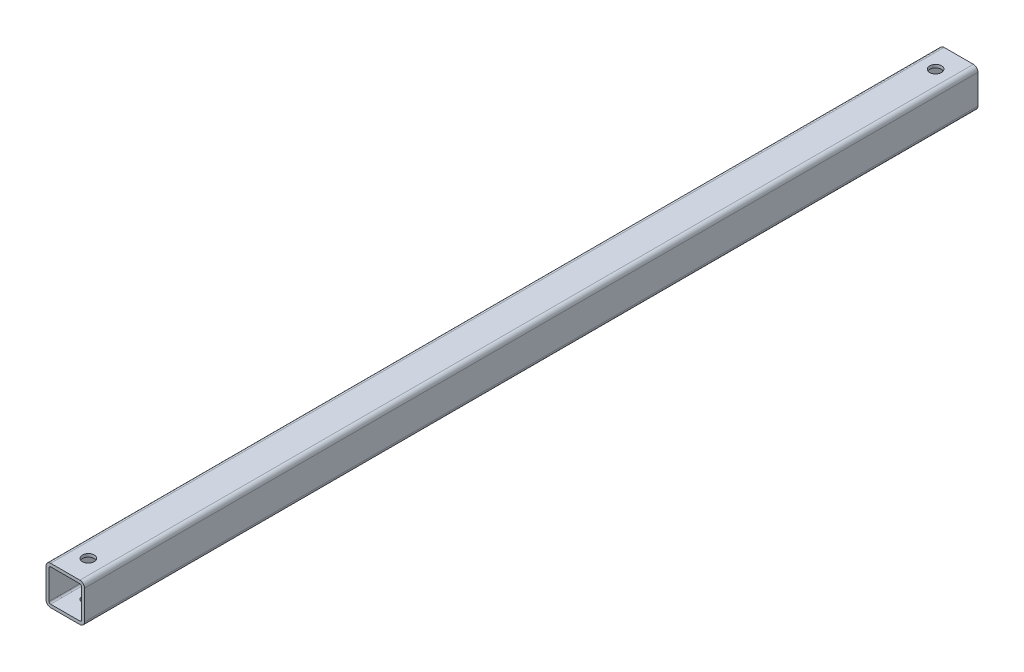
ISO-10303-21;
HEADER;
FILE_DESCRIPTION(('STEP AP214'),'2;1');
FILE_NAME('part.step','',(''),(''),'','','');
FILE_SCHEMA(('AUTOMOTIVE_DESIGN { 1 0 10303 214 1 1 1 1 }'));
ENDSEC;
DATA;
#1=APPLICATION_CONTEXT('core data for automotive mechanical design processes');
#2=APPLICATION_PROTOCOL_DEFINITION('international standard','automotive_design',2000,#1);
#3=PRODUCT_CONTEXT('',#1,'mechanical');
#4=PRODUCT('Part','Part','',(#3));
#5=PRODUCT_RELATED_PRODUCT_CATEGORY('part','',(#4));
#6=PRODUCT_DEFINITION_FORMATION('','',#4);
#7=PRODUCT_DEFINITION_CONTEXT('part definition',#1,'design');
#8=PRODUCT_DEFINITION('design','',#6,#7);
#9=PRODUCT_DEFINITION_SHAPE('','',#8);
#10=(LENGTH_UNIT() NAMED_UNIT(*) SI_UNIT(.MILLI.,.METRE.));
#11=(NAMED_UNIT(*) PLANE_ANGLE_UNIT() SI_UNIT($,.RADIAN.));
#12=(NAMED_UNIT(*) SI_UNIT($,.STERADIAN.) SOLID_ANGLE_UNIT());
#13=UNCERTAINTY_MEASURE_WITH_UNIT(LENGTH_MEASURE(1.E-05),#10,'distance_accuracy_value','');
#14=(GEOMETRIC_REPRESENTATION_CONTEXT(3) GLOBAL_UNCERTAINTY_ASSIGNED_CONTEXT((#13)) GLOBAL_UNIT_ASSIGNED_CONTEXT((#10,
#11,#12)) REPRESENTATION_CONTEXT('',''));
#15=CARTESIAN_POINT('',(0.,0.,0.));
#16=DIRECTION('',(0.,0.,1.));
#17=DIRECTION('',(1.,0.,0.));
#18=AXIS2_PLACEMENT_3D('',#15,#16,#17);
#19=CARTESIAN_POINT('',(7.67386154620908E-12,1.48148160405981E-11,580.000000000016));
#20=DIRECTION('',(0.,0.,1.));
#21=DIRECTION('',(1.,0.,0.));
#22=AXIS2_PLACEMENT_3D('',#19,#20,#21);
#23=PLANE('',#22);
#24=DIRECTION('',(0.,1.,0.));
#25=VECTOR('',#24,1.);
#26=CARTESIAN_POINT('',(-12.4999999999923,-4.7499999999852,580.000000000016));
#27=LINE('',#26,#25);
#28=CARTESIAN_POINT('',(-12.4999999999923,-9.49999999998518,580.000000000016));
#29=VERTEX_POINT('',#28);
#30=CARTESIAN_POINT('',(-12.4999999999923,9.50000000001481,580.000000000016));
#31=VERTEX_POINT('',#30);
#32=EDGE_CURVE('E193',#29,#31,#27,.T.);
#33=ORIENTED_EDGE('',*,*,#32,.F.);
#34=CARTESIAN_POINT('',(-9.49999999999235,-9.49999999998518,580.000000000016));
#35=DIRECTION('',(0.,0.,-1.));
#36=DIRECTION('',(1.,0.,0.));
#37=AXIS2_PLACEMENT_3D('',#34,#35,#36);
#38=CIRCLE('',#37,3.);
#39=CARTESIAN_POINT('',(-9.49999999999235,-12.4999999999852,580.000000000016));
#40=VERTEX_POINT('',#39);
#41=EDGE_CURVE('E253',#40,#29,#38,.T.);
#42=ORIENTED_EDGE('',*,*,#41,.F.);
#43=DIRECTION('',(-1.,0.,0.));
#44=VECTOR('',#43,1.);
#45=CARTESIAN_POINT('',(4.75000000000776,-12.4999999999852,580.000000000016));
#46=LINE('',#45,#44);
#47=CARTESIAN_POINT('',(9.5000000000077,-12.4999999999852,580.000000000017));
#48=VERTEX_POINT('',#47);
#49=EDGE_CURVE('E238',#48,#40,#46,.T.);
#50=ORIENTED_EDGE('',*,*,#49,.F.);
#51=CARTESIAN_POINT('',(9.5000000000077,-9.49999999998518,580.000000000016));
#52=DIRECTION('',(0.,0.,-1.));
#53=DIRECTION('',(0.,1.,0.));
#54=AXIS2_PLACEMENT_3D('',#51,#52,#53);
#55=CIRCLE('',#54,3.);
#56=CARTESIAN_POINT('',(12.5000000000077,-9.49999999998518,580.000000000016));
#57=VERTEX_POINT('',#56);
#58=EDGE_CURVE('E332',#57,#48,#55,.T.);
#59=ORIENTED_EDGE('',*,*,#58,.F.);
#60=DIRECTION('',(0.,-1.,0.));
#61=VECTOR('',#60,1.);
#62=CARTESIAN_POINT('',(12.5000000000077,4.75000000001483,580.000000000017));
#63=LINE('',#62,#61);
#64=CARTESIAN_POINT('',(12.5000000000077,9.50000000001481,580.000000000016));
#65=VERTEX_POINT('',#64);
#66=EDGE_CURVE('E309',#65,#57,#63,.T.);
#67=ORIENTED_EDGE('',*,*,#66,.F.);
#68=CARTESIAN_POINT('',(9.5000000000077,9.50000000001481,580.000000000016));
#69=DIRECTION('',(0.,0.,-1.));
#70=DIRECTION('',(-1.,0.,0.));
#71=AXIS2_PLACEMENT_3D('',#68,#69,#70);
#72=CIRCLE('',#71,3.);
#73=CARTESIAN_POINT('',(9.5000000000077,12.5000000000148,580.000000000017));
#74=VERTEX_POINT('',#73);
#75=EDGE_CURVE('E27',#74,#65,#72,.T.);
#76=ORIENTED_EDGE('',*,*,#75,.F.);
#77=DIRECTION('',(1.,0.,0.));
#78=VECTOR('',#77,1.);
#79=CARTESIAN_POINT('',(-4.74999999999227,12.5000000000148,580.000000000017));
#80=LINE('',#79,#78);
#81=CARTESIAN_POINT('',(-9.49999999999235,12.5000000000148,580.000000000016));
#82=VERTEX_POINT('',#81);
#83=EDGE_CURVE('E259',#82,#74,#80,.T.);
#84=ORIENTED_EDGE('',*,*,#83,.F.);
#85=CARTESIAN_POINT('',(-9.49999999999235,9.50000000001481,580.000000000016));
#86=DIRECTION('',(0.,0.,-1.));
#87=DIRECTION('',(0.,-1.,0.));
#88=AXIS2_PLACEMENT_3D('',#85,#86,#87);
#89=CIRCLE('',#88,3.);
#90=EDGE_CURVE('E217',#31,#82,#89,.T.);
#91=ORIENTED_EDGE('',*,*,#90,.F.);
#92=EDGE_LOOP('',(#33,#42,#50,#59,#67,#76,#84,#91));
#93=FACE_BOUND('',#92,.T.);
#94=DIRECTION('',(-1.,0.,0.));
#95=VECTOR('',#94,1.);
#96=CARTESIAN_POINT('',(-4.74999999999227,10.5000000000148,580.000000000016));
#97=LINE('',#96,#95);
#98=CARTESIAN_POINT('',(9.5000000000077,10.5000000000148,580.000000000016));
#99=VERTEX_POINT('',#98);
#100=CARTESIAN_POINT('',(-9.49999999999235,10.5000000000148,580.000000000016));
#101=VERTEX_POINT('',#100);
#102=EDGE_CURVE('E264',#99,#101,#97,.T.);
#103=ORIENTED_EDGE('',*,*,#102,.F.);
#104=CARTESIAN_POINT('',(9.5000000000077,9.50000000001481,580.000000000016));
#105=DIRECTION('',(0.,0.,1.));
#106=DIRECTION('',(-1.,0.,0.));
#107=AXIS2_PLACEMENT_3D('',#104,#105,#106);
#108=CIRCLE('',#107,1.);
#109=CARTESIAN_POINT('',(10.5000000000076,9.50000000001481,580.000000000016));
#110=VERTEX_POINT('',#109);
#111=EDGE_CURVE('E243',#110,#99,#108,.T.);
#112=ORIENTED_EDGE('',*,*,#111,.F.);
#113=DIRECTION('',(0.,1.,0.));
#114=VECTOR('',#113,1.);
#115=CARTESIAN_POINT('',(10.5000000000076,4.75000000001483,580.000000000017));
#116=LINE('',#115,#114);
#117=CARTESIAN_POINT('',(10.5000000000076,-9.49999999998518,580.000000000016));
#118=VERTEX_POINT('',#117);
#119=EDGE_CURVE('E228',#118,#110,#116,.T.);
#120=ORIENTED_EDGE('',*,*,#119,.F.);
#121=CARTESIAN_POINT('',(9.5000000000077,-9.49999999998518,580.000000000016));
#122=DIRECTION('',(0.,0.,1.));
#123=DIRECTION('',(0.,1.,0.));
#124=AXIS2_PLACEMENT_3D('',#121,#122,#123);
#125=CIRCLE('',#124,1.);
#126=CARTESIAN_POINT('',(9.5000000000077,-10.4999999999852,580.000000000016));
#127=VERTEX_POINT('',#126);
#128=EDGE_CURVE('E281',#127,#118,#125,.T.);
#129=ORIENTED_EDGE('',*,*,#128,.F.);
#130=DIRECTION('',(1.,0.,0.));
#131=VECTOR('',#130,1.);
#132=CARTESIAN_POINT('',(4.75000000000776,-10.4999999999852,580.000000000016));
#133=LINE('',#132,#131);
#134=CARTESIAN_POINT('',(-9.49999999999235,-10.4999999999852,580.000000000016));
#135=VERTEX_POINT('',#134);
#136=EDGE_CURVE('E294',#135,#127,#133,.T.);
#137=ORIENTED_EDGE('',*,*,#136,.F.);
#138=CARTESIAN_POINT('',(-9.49999999999235,-9.49999999998518,580.000000000016));
#139=DIRECTION('',(0.,0.,1.));
#140=DIRECTION('',(1.,0.,0.));
#141=AXIS2_PLACEMENT_3D('',#138,#139,#140);
#142=CIRCLE('',#141,1.);
#143=CARTESIAN_POINT('',(-10.4999999999923,-9.49999999998518,580.000000000016));
#144=VERTEX_POINT('',#143);
#145=EDGE_CURVE('E219',#144,#135,#142,.T.);
#146=ORIENTED_EDGE('',*,*,#145,.F.);
#147=DIRECTION('',(0.,-1.,0.));
#148=VECTOR('',#147,1.);
#149=CARTESIAN_POINT('',(-10.4999999999923,-4.74999999998516,580.000000000016));
#150=LINE('',#149,#148);
#151=CARTESIAN_POINT('',(-10.4999999999923,9.50000000001481,580.000000000016));
#152=VERTEX_POINT('',#151);
#153=EDGE_CURVE('E208',#152,#144,#150,.T.);
#154=ORIENTED_EDGE('',*,*,#153,.F.);
#155=CARTESIAN_POINT('',(-9.49999999999235,9.50000000001481,580.000000000016));
#156=DIRECTION('',(0.,0.,1.));
#157=DIRECTION('',(0.,-1.,0.));
#158=AXIS2_PLACEMENT_3D('',#155,#156,#157);
#159=CIRCLE('',#158,1.);
#160=EDGE_CURVE('E194',#101,#152,#159,.T.);
#161=ORIENTED_EDGE('',*,*,#160,.F.);
#162=EDGE_LOOP('',(#103,#112,#120,#129,#137,#146,#154,#161));
#163=FACE_BOUND('',#162,.T.);
#164=ADVANCED_FACE('F16',(#93,#163),#23,.T.);
#165=CARTESIAN_POINT('',(1.10844666778576E-11,1.48148160405981E-11,1.66267000167863E-11));
#166=DIRECTION('',(0.,0.,1.));
#167=DIRECTION('',(1.,0.,0.));
#168=AXIS2_PLACEMENT_3D('',#165,#166,#167);
#169=PLANE('',#168);
#170=DIRECTION('',(0.,1.,0.));
#171=VECTOR('',#170,1.);
#172=CARTESIAN_POINT('',(-12.4999999999889,-4.7499999999852,1.66267000167863E-11));
#173=LINE('',#172,#171);
#174=CARTESIAN_POINT('',(-12.4999999999889,-9.49999999998518,1.66267000167863E-11));
#175=VERTEX_POINT('',#174);
#176=CARTESIAN_POINT('',(-12.4999999999889,9.50000000001481,1.62003743753303E-11));
#177=VERTEX_POINT('',#176);
#178=EDGE_CURVE('E248',#175,#177,#173,.T.);
#179=ORIENTED_EDGE('',*,*,#178,.T.);
#180=CARTESIAN_POINT('',(-9.49999999998894,9.50000000001481,1.62003743753303E-11));
#181=DIRECTION('',(0.,0.,-1.));
#182=DIRECTION('',(0.,-1.,0.));
#183=AXIS2_PLACEMENT_3D('',#180,#181,#182);
#184=CIRCLE('',#183,3.);
#185=CARTESIAN_POINT('',(-9.49999999998894,12.5000000000148,1.66267000167863E-11));
#186=VERTEX_POINT('',#185);
#187=EDGE_CURVE('E263',#177,#186,#184,.T.);
#188=ORIENTED_EDGE('',*,*,#187,.T.);
#189=DIRECTION('',(1.,0.,0.));
#190=VECTOR('',#189,1.);
#191=CARTESIAN_POINT('',(-4.74999999998886,12.5000000000148,1.66267000167863E-11));
#192=LINE('',#191,#190);
#193=CARTESIAN_POINT('',(9.50000000001111,12.5000000000148,1.70530256582424E-11));
#194=VERTEX_POINT('',#193);
#195=EDGE_CURVE('E244',#186,#194,#192,.T.);
#196=ORIENTED_EDGE('',*,*,#195,.T.);
#197=CARTESIAN_POINT('',(9.50000000001111,9.50000000001481,1.66267000167863E-11));
#198=DIRECTION('',(0.,0.,-1.));
#199=DIRECTION('',(-1.,0.,0.));
#200=AXIS2_PLACEMENT_3D('',#197,#198,#199);
#201=CIRCLE('',#200,3.);
#202=CARTESIAN_POINT('',(12.5000000000111,9.50000000001481,1.66267000167863E-11));
#203=VERTEX_POINT('',#202);
#204=EDGE_CURVE('E11',#194,#203,#201,.T.);
#205=ORIENTED_EDGE('',*,*,#204,.T.);
#206=DIRECTION('',(0.,-1.,0.));
#207=VECTOR('',#206,1.);
#208=CARTESIAN_POINT('',(12.5000000000111,4.75000000001483,1.66267000167863E-11));
#209=LINE('',#208,#207);
#210=CARTESIAN_POINT('',(12.5000000000111,-9.49999999998518,1.70530256582424E-11));
#211=VERTEX_POINT('',#210);
#212=EDGE_CURVE('E333',#203,#211,#209,.T.);
#213=ORIENTED_EDGE('',*,*,#212,.T.);
#214=CARTESIAN_POINT('',(9.50000000001111,-9.49999999998518,1.70530256582424E-11));
#215=DIRECTION('',(0.,0.,-1.));
#216=DIRECTION('',(0.,1.,0.));
#217=AXIS2_PLACEMENT_3D('',#214,#215,#216);
#218=CIRCLE('',#217,3.);
#219=CARTESIAN_POINT('',(9.50000000001111,-12.4999999999852,1.66267000167863E-11));
#220=VERTEX_POINT('',#219);
#221=EDGE_CURVE('E234',#211,#220,#218,.T.);
#222=ORIENTED_EDGE('',*,*,#221,.T.);
#223=DIRECTION('',(-1.,0.,0.));
#224=VECTOR('',#223,1.);
#225=CARTESIAN_POINT('',(4.75000000001103,-12.4999999999852,1.66267000167863E-11));
#226=LINE('',#225,#224);
#227=CARTESIAN_POINT('',(-9.49999999998894,-12.4999999999852,1.62003743753303E-11));
#228=VERTEX_POINT('',#227);
#229=EDGE_CURVE('E258',#220,#228,#226,.T.);
#230=ORIENTED_EDGE('',*,*,#229,.T.);
#231=CARTESIAN_POINT('',(-9.49999999998894,-9.49999999998518,1.66267000167863E-11));
#232=DIRECTION('',(0.,0.,-1.));
#233=DIRECTION('',(1.,0.,0.));
#234=AXIS2_PLACEMENT_3D('',#231,#232,#233);
#235=CIRCLE('',#234,3.);
#236=EDGE_CURVE('E269',#228,#175,#235,.T.);
#237=ORIENTED_EDGE('',*,*,#236,.T.);
#238=EDGE_LOOP('',(#179,#188,#196,#205,#213,#222,#230,#237));
#239=FACE_BOUND('',#238,.T.);
#240=DIRECTION('',(-1.,0.,0.));
#241=VECTOR('',#240,1.);
#242=CARTESIAN_POINT('',(-4.74999999998886,10.5000000000148,1.66267000167863E-11));
#243=LINE('',#242,#241);
#244=CARTESIAN_POINT('',(9.50000000001111,10.5000000000148,1.70530256582424E-11));
#245=VERTEX_POINT('',#244);
#246=CARTESIAN_POINT('',(-9.49999999998894,10.5000000000148,1.66267000167863E-11));
#247=VERTEX_POINT('',#246);
#248=EDGE_CURVE('E188',#245,#247,#243,.T.);
#249=ORIENTED_EDGE('',*,*,#248,.T.);
#250=CARTESIAN_POINT('',(-9.49999999998894,9.50000000001481,1.62003743753303E-11));
#251=DIRECTION('',(0.,0.,1.));
#252=DIRECTION('',(0.,-1.,0.));
#253=AXIS2_PLACEMENT_3D('',#250,#251,#252);
#254=CIRCLE('',#253,1.);
#255=CARTESIAN_POINT('',(-10.4999999999889,9.50000000001481,1.62003743753303E-11));
#256=VERTEX_POINT('',#255);
#257=EDGE_CURVE('E181',#247,#256,#254,.T.);
#258=ORIENTED_EDGE('',*,*,#257,.T.);
#259=DIRECTION('',(0.,-1.,0.));
#260=VECTOR('',#259,1.);
#261=CARTESIAN_POINT('',(-10.4999999999889,-4.7499999999852,1.66267000167863E-11));
#262=LINE('',#261,#260);
#263=CARTESIAN_POINT('',(-10.4999999999889,-9.49999999998518,1.66267000167863E-11));
#264=VERTEX_POINT('',#263);
#265=EDGE_CURVE('E185',#256,#264,#262,.T.);
#266=ORIENTED_EDGE('',*,*,#265,.T.);
#267=CARTESIAN_POINT('',(-9.49999999998894,-9.49999999998518,1.66267000167863E-11));
#268=DIRECTION('',(0.,0.,1.));
#269=DIRECTION('',(1.,0.,0.));
#270=AXIS2_PLACEMENT_3D('',#267,#268,#269);
#271=CIRCLE('',#270,1.);
#272=CARTESIAN_POINT('',(-9.49999999998894,-10.4999999999852,1.62003743753303E-11));
#273=VERTEX_POINT('',#272);
#274=EDGE_CURVE('E222',#264,#273,#271,.T.);
#275=ORIENTED_EDGE('',*,*,#274,.T.);
#276=DIRECTION('',(1.,0.,0.));
#277=VECTOR('',#276,1.);
#278=CARTESIAN_POINT('',(4.75000000001103,-10.4999999999852,1.66267000167863E-11));
#279=LINE('',#278,#277);
#280=CARTESIAN_POINT('',(9.50000000001111,-10.4999999999852,1.66267000167863E-11));
#281=VERTEX_POINT('',#280);
#282=EDGE_CURVE('E317',#273,#281,#279,.T.);
#283=ORIENTED_EDGE('',*,*,#282,.T.);
#284=CARTESIAN_POINT('',(9.50000000001111,-9.49999999998518,1.70530256582424E-11));
#285=DIRECTION('',(0.,0.,1.));
#286=DIRECTION('',(0.,1.,0.));
#287=AXIS2_PLACEMENT_3D('',#284,#285,#286);
#288=CIRCLE('',#287,1.);
#289=CARTESIAN_POINT('',(10.5000000000111,-9.49999999998518,1.70530256582424E-11));
#290=VERTEX_POINT('',#289);
#291=EDGE_CURVE('E233',#281,#290,#288,.T.);
#292=ORIENTED_EDGE('',*,*,#291,.T.);
#293=DIRECTION('',(0.,1.,0.));
#294=VECTOR('',#293,1.);
#295=CARTESIAN_POINT('',(10.5000000000111,4.75000000001483,1.66267000167863E-11));
#296=LINE('',#295,#294);
#297=CARTESIAN_POINT('',(10.5000000000111,9.50000000001481,1.66267000167863E-11));
#298=VERTEX_POINT('',#297);
#299=EDGE_CURVE('E239',#290,#298,#296,.T.);
#300=ORIENTED_EDGE('',*,*,#299,.T.);
#301=CARTESIAN_POINT('',(9.50000000001111,9.50000000001481,1.66267000167863E-11));
#302=DIRECTION('',(0.,0.,1.));
#303=DIRECTION('',(-1.,0.,0.));
#304=AXIS2_PLACEMENT_3D('',#301,#302,#303);
#305=CIRCLE('',#304,1.);
#306=EDGE_CURVE('E314',#298,#245,#305,.T.);
#307=ORIENTED_EDGE('',*,*,#306,.T.);
#308=EDGE_LOOP('',(#249,#258,#266,#275,#283,#292,#300,#307));
#309=FACE_BOUND('',#308,.T.);
#310=ADVANCED_FACE('F183',(#239,#309),#169,.F.);
#311=CARTESIAN_POINT('',(9.50000000001111,9.50000000001481,1.66267000167863E-11));
#312=DIRECTION('',(0.,0.,1.));
#313=DIRECTION('',(-1.,0.,0.));
#314=AXIS2_PLACEMENT_3D('',#311,#312,#313);
#315=CYLINDRICAL_SURFACE('',#314,3.);
#316=ORIENTED_EDGE('',*,*,#75,.T.);
#317=DIRECTION('',(0.,0.,1.));
#318=VECTOR('',#317,1.);
#319=CARTESIAN_POINT('',(12.5000000000111,9.50000000001481,1.66267000167863E-11));
#320=LINE('',#319,#318);
#321=EDGE_CURVE('E328',#203,#65,#320,.T.);
#322=ORIENTED_EDGE('',*,*,#321,.F.);
#323=ORIENTED_EDGE('',*,*,#204,.F.);
#324=DIRECTION('',(0.,0.,1.));
#325=VECTOR('',#324,1.);
#326=CARTESIAN_POINT('',(9.50000000001111,12.5000000000148,1.70530256582424E-11));
#327=LINE('',#326,#325);
#328=EDGE_CURVE('E247',#194,#74,#327,.T.);
#329=ORIENTED_EDGE('',*,*,#328,.T.);
#330=EDGE_LOOP('',(#316,#322,#323,#329));
#331=FACE_BOUND('',#330,.T.);
#332=ADVANCED_FACE('F455',(#331),#315,.T.);
#333=CARTESIAN_POINT('',(-9.49999999998894,12.5000000000148,1.66267000167863E-11));
#334=DIRECTION('',(0.,1.,0.));
#335=DIRECTION('',(1.,0.,0.));
#336=AXIS2_PLACEMENT_3D('',#333,#334,#335);
#337=PLANE('',#336);
#338=ORIENTED_EDGE('',*,*,#83,.T.);
#339=ORIENTED_EDGE('',*,*,#328,.F.);
#340=ORIENTED_EDGE('',*,*,#195,.F.);
#341=DIRECTION('',(0.,0.,1.));
#342=VECTOR('',#341,1.);
#343=CARTESIAN_POINT('',(-9.49999999998894,12.5000000000148,1.66267000167863E-11));
#344=LINE('',#343,#342);
#345=EDGE_CURVE('E299',#186,#82,#344,.T.);
#346=ORIENTED_EDGE('',*,*,#345,.T.);
#347=EDGE_LOOP('',(#338,#339,#340,#346));
#348=FACE_BOUND('',#347,.T.);
#349=CARTESIAN_POINT('',(7.67386154620908E-12,12.5000000000148,565.00000000001));
#350=DIRECTION('',(0.,-1.,0.));
#351=DIRECTION('',(0.,0.,-1.));
#352=AXIS2_PLACEMENT_3D('',#349,#350,#351);
#353=CIRCLE('',#352,3.8235);
#354=CARTESIAN_POINT('',(7.67386154620908E-12,12.5000000000148,561.17650000001));
#355=VERTEX_POINT('',#354);
#356=EDGE_CURVE('E223',#355,#355,#353,.T.);
#357=ORIENTED_EDGE('',*,*,#356,.T.);
#358=EDGE_LOOP('',(#357));
#359=FACE_BOUND('',#358,.T.);
#360=CARTESIAN_POINT('',(1.09423581307055E-11,12.5000000000148,15.0000000000168));
#361=DIRECTION('',(0.,-1.,0.));
#362=DIRECTION('',(0.,0.,-1.));
#363=AXIS2_PLACEMENT_3D('',#360,#361,#362);
#364=CIRCLE('',#363,3.8235);
#365=CARTESIAN_POINT('',(1.09423581307055E-11,12.5000000000148,11.1765000000167));
#366=VERTEX_POINT('',#365);
#367=EDGE_CURVE('E380',#366,#366,#364,.T.);
#368=ORIENTED_EDGE('',*,*,#367,.T.);
#369=EDGE_LOOP('',(#368));
#370=FACE_BOUND('',#369,.T.);
#371=ADVANCED_FACE('F453',(#348,#359,#370),#337,.T.);
#372=CARTESIAN_POINT('',(-9.49999999998894,9.50000000001481,1.62003743753303E-11));
#373=DIRECTION('',(0.,0.,1.));
#374=DIRECTION('',(0.,-1.,0.));
#375=AXIS2_PLACEMENT_3D('',#372,#373,#374);
#376=CYLINDRICAL_SURFACE('',#375,3.);
#377=ORIENTED_EDGE('',*,*,#90,.T.);
#378=ORIENTED_EDGE('',*,*,#345,.F.);
#379=ORIENTED_EDGE('',*,*,#187,.F.);
#380=DIRECTION('',(0.,0.,1.));
#381=VECTOR('',#380,1.);
#382=CARTESIAN_POINT('',(-12.4999999999889,9.50000000001481,1.62003743753303E-11));
#383=LINE('',#382,#381);
#384=EDGE_CURVE('E252',#177,#31,#383,.T.);
#385=ORIENTED_EDGE('',*,*,#384,.T.);
#386=EDGE_LOOP('',(#377,#378,#379,#385));
#387=FACE_BOUND('',#386,.T.);
#388=ADVANCED_FACE('F451',(#387),#376,.T.);
#389=CARTESIAN_POINT('',(-12.4999999999889,-9.49999999998518,1.66267000167863E-11));
#390=DIRECTION('',(-1.,0.,0.));
#391=DIRECTION('',(0.,0.,1.));
#392=AXIS2_PLACEMENT_3D('',#389,#390,#391);
#393=PLANE('',#392);
#394=ORIENTED_EDGE('',*,*,#32,.T.);
#395=ORIENTED_EDGE('',*,*,#384,.F.);
#396=ORIENTED_EDGE('',*,*,#178,.F.);
#397=DIRECTION('',(0.,0.,1.));
#398=VECTOR('',#397,1.);
#399=CARTESIAN_POINT('',(-12.4999999999889,-9.49999999998518,1.66267000167863E-11));
#400=LINE('',#399,#398);
#401=EDGE_CURVE('E257',#175,#29,#400,.T.);
#402=ORIENTED_EDGE('',*,*,#401,.T.);
#403=EDGE_LOOP('',(#394,#395,#396,#402));
#404=FACE_BOUND('',#403,.T.);
#405=ADVANCED_FACE('F447',(#404),#393,.T.);
#406=CARTESIAN_POINT('',(-9.49999999998894,9.50000000001481,1.62003743753303E-11));
#407=DIRECTION('',(0.,0.,1.));
#408=DIRECTION('',(0.,-1.,0.));
#409=AXIS2_PLACEMENT_3D('',#406,#407,#408);
#410=CYLINDRICAL_SURFACE('',#409,1.);
#411=ORIENTED_EDGE('',*,*,#160,.T.);
#412=DIRECTION('',(0.,0.,1.));
#413=VECTOR('',#412,1.);
#414=CARTESIAN_POINT('',(-10.4999999999889,9.50000000001481,1.62003743753303E-11));
#415=LINE('',#414,#413);
#416=EDGE_CURVE('E197',#256,#152,#415,.T.);
#417=ORIENTED_EDGE('',*,*,#416,.F.);
#418=ORIENTED_EDGE('',*,*,#257,.F.);
#419=DIRECTION('',(0.,0.,1.));
#420=VECTOR('',#419,1.);
#421=CARTESIAN_POINT('',(-9.49999999998894,10.5000000000148,1.66267000167863E-11));
#422=LINE('',#421,#420);
#423=EDGE_CURVE('E268',#247,#101,#422,.T.);
#424=ORIENTED_EDGE('',*,*,#423,.T.);
#425=EDGE_LOOP('',(#411,#417,#418,#424));
#426=FACE_BOUND('',#425,.T.);
#427=ADVANCED_FACE('F198',(#426),#410,.F.);
#428=CARTESIAN_POINT('',(-10.4999999999889,-9.49999999998518,1.66267000167863E-11));
#429=DIRECTION('',(-1.,0.,0.));
#430=DIRECTION('',(0.,0.,1.));
#431=AXIS2_PLACEMENT_3D('',#428,#429,#430);
#432=PLANE('',#431);
#433=ORIENTED_EDGE('',*,*,#153,.T.);
#434=DIRECTION('',(0.,0.,1.));
#435=VECTOR('',#434,1.);
#436=CARTESIAN_POINT('',(-10.4999999999889,-9.49999999998518,1.66267000167863E-11));
#437=LINE('',#436,#435);
#438=EDGE_CURVE('E205',#264,#144,#437,.T.);
#439=ORIENTED_EDGE('',*,*,#438,.F.);
#440=ORIENTED_EDGE('',*,*,#265,.F.);
#441=ORIENTED_EDGE('',*,*,#416,.T.);
#442=EDGE_LOOP('',(#433,#439,#440,#441));
#443=FACE_BOUND('',#442,.T.);
#444=ADVANCED_FACE('F203',(#443),#432,.F.);
#445=CARTESIAN_POINT('',(-9.49999999998894,-9.49999999998518,1.66267000167863E-11));
#446=DIRECTION('',(0.,0.,1.));
#447=DIRECTION('',(1.,0.,0.));
#448=AXIS2_PLACEMENT_3D('',#445,#446,#447);
#449=CYLINDRICAL_SURFACE('',#448,1.);
#450=ORIENTED_EDGE('',*,*,#145,.T.);
#451=DIRECTION('',(0.,0.,1.));
#452=VECTOR('',#451,1.);
#453=CARTESIAN_POINT('',(-9.49999999998894,-10.4999999999852,1.62003743753303E-11));
#454=LINE('',#453,#452);
#455=EDGE_CURVE('E286',#273,#135,#454,.T.);
#456=ORIENTED_EDGE('',*,*,#455,.F.);
#457=ORIENTED_EDGE('',*,*,#274,.F.);
#458=ORIENTED_EDGE('',*,*,#438,.T.);
#459=EDGE_LOOP('',(#450,#456,#457,#458));
#460=FACE_BOUND('',#459,.T.);
#461=ADVANCED_FACE('F416',(#460),#449,.F.);
#462=CARTESIAN_POINT('',(-9.49999999998894,10.5000000000148,1.66267000167863E-11));
#463=DIRECTION('',(0.,1.,0.));
#464=DIRECTION('',(1.,0.,0.));
#465=AXIS2_PLACEMENT_3D('',#462,#463,#464);
#466=PLANE('',#465);
#467=ORIENTED_EDGE('',*,*,#102,.T.);
#468=ORIENTED_EDGE('',*,*,#423,.F.);
#469=ORIENTED_EDGE('',*,*,#248,.F.);
#470=DIRECTION('',(0.,0.,1.));
#471=VECTOR('',#470,1.);
#472=CARTESIAN_POINT('',(9.50000000001111,10.5000000000148,1.70530256582424E-11));
#473=LINE('',#472,#471);
#474=EDGE_CURVE('E334',#245,#99,#473,.T.);
#475=ORIENTED_EDGE('',*,*,#474,.T.);
#476=EDGE_LOOP('',(#467,#468,#469,#475));
#477=FACE_BOUND('',#476,.T.);
#478=CARTESIAN_POINT('',(7.67386154620908E-12,10.5000000000148,565.00000000001));
#479=DIRECTION('',(0.,1.,0.));
#480=DIRECTION('',(0.,0.,-1.));
#481=AXIS2_PLACEMENT_3D('',#478,#479,#480);
#482=CIRCLE('',#481,3.8235);
#483=CARTESIAN_POINT('',(7.67386154620908E-12,10.5000000000148,568.82350000001));
#484=VERTEX_POINT('',#483);
#485=EDGE_CURVE('E226',#484,#484,#482,.T.);
#486=ORIENTED_EDGE('',*,*,#485,.T.);
#487=EDGE_LOOP('',(#486));
#488=FACE_BOUND('',#487,.T.);
#489=CARTESIAN_POINT('',(1.09423581307055E-11,10.5000000000148,15.0000000000168));
#490=DIRECTION('',(0.,1.,0.));
#491=DIRECTION('',(0.,0.,-1.));
#492=AXIS2_PLACEMENT_3D('',#489,#490,#491);
#493=CIRCLE('',#492,3.8235);
#494=CARTESIAN_POINT('',(1.09423581307055E-11,10.5000000000148,18.8235000000168));
#495=VERTEX_POINT('',#494);
#496=EDGE_CURVE('E305',#495,#495,#493,.T.);
#497=ORIENTED_EDGE('',*,*,#496,.T.);
#498=EDGE_LOOP('',(#497));
#499=FACE_BOUND('',#498,.T.);
#500=ADVANCED_FACE('F395',(#477,#488,#499),#466,.F.);
#501=CARTESIAN_POINT('',(-9.49999999998894,-9.49999999998518,1.66267000167863E-11));
#502=DIRECTION('',(0.,0.,1.));
#503=DIRECTION('',(1.,0.,0.));
#504=AXIS2_PLACEMENT_3D('',#501,#502,#503);
#505=CYLINDRICAL_SURFACE('',#504,3.);
#506=ORIENTED_EDGE('',*,*,#41,.T.);
#507=ORIENTED_EDGE('',*,*,#401,.F.);
#508=ORIENTED_EDGE('',*,*,#236,.F.);
#509=DIRECTION('',(0.,0.,1.));
#510=VECTOR('',#509,1.);
#511=CARTESIAN_POINT('',(-9.49999999998894,-12.4999999999852,1.62003743753303E-11));
#512=LINE('',#511,#510);
#513=EDGE_CURVE('E287',#228,#40,#512,.T.);
#514=ORIENTED_EDGE('',*,*,#513,.T.);
#515=EDGE_LOOP('',(#506,#507,#508,#514));
#516=FACE_BOUND('',#515,.T.);
#517=ADVANCED_FACE('F435',(#516),#505,.T.);
#518=CARTESIAN_POINT('',(9.50000000001111,-12.4999999999852,1.66267000167863E-11));
#519=DIRECTION('',(0.,-1.,0.));
#520=DIRECTION('',(0.,0.,-1.));
#521=AXIS2_PLACEMENT_3D('',#518,#519,#520);
#522=PLANE('',#521);
#523=ORIENTED_EDGE('',*,*,#49,.T.);
#524=ORIENTED_EDGE('',*,*,#513,.F.);
#525=ORIENTED_EDGE('',*,*,#229,.F.);
#526=DIRECTION('',(0.,0.,1.));
#527=VECTOR('',#526,1.);
#528=CARTESIAN_POINT('',(9.50000000001111,-12.4999999999852,1.66267000167863E-11));
#529=LINE('',#528,#527);
#530=EDGE_CURVE('E20',#220,#48,#529,.T.);
#531=ORIENTED_EDGE('',*,*,#530,.T.);
#532=EDGE_LOOP('',(#523,#524,#525,#531));
#533=FACE_BOUND('',#532,.T.);
#534=CARTESIAN_POINT('',(7.67386154620908E-12,-12.4999999999852,565.00000000001));
#535=DIRECTION('',(0.,1.,0.));
#536=DIRECTION('',(0.,0.,-1.));
#537=AXIS2_PLACEMENT_3D('',#534,#535,#536);
#538=CIRCLE('',#537,3.8235);
#539=CARTESIAN_POINT('',(7.67386154620908E-12,-12.4999999999852,568.82350000001));
#540=VERTEX_POINT('',#539);
#541=EDGE_CURVE('E291',#540,#540,#538,.T.);
#542=ORIENTED_EDGE('',*,*,#541,.T.);
#543=EDGE_LOOP('',(#542));
#544=FACE_BOUND('',#543,.T.);
#545=CARTESIAN_POINT('',(1.09423581307055E-11,-12.4999999999852,15.0000000000166));
#546=DIRECTION('',(0.,1.,0.));
#547=DIRECTION('',(0.,0.,-1.));
#548=AXIS2_PLACEMENT_3D('',#545,#546,#547);
#549=CIRCLE('',#548,3.8235);
#550=CARTESIAN_POINT('',(1.09423581307055E-11,-12.4999999999852,18.8235000000167));
#551=VERTEX_POINT('',#550);
#552=EDGE_CURVE('E227',#551,#551,#549,.T.);
#553=ORIENTED_EDGE('',*,*,#552,.T.);
#554=EDGE_LOOP('',(#553));
#555=FACE_BOUND('',#554,.T.);
#556=ADVANCED_FACE('F18',(#533,#544,#555),#522,.T.);
#557=CARTESIAN_POINT('',(9.50000000001111,-9.49999999998518,1.70530256582424E-11));
#558=DIRECTION('',(0.,0.,1.));
#559=DIRECTION('',(0.,1.,0.));
#560=AXIS2_PLACEMENT_3D('',#557,#558,#559);
#561=CYLINDRICAL_SURFACE('',#560,3.);
#562=ORIENTED_EDGE('',*,*,#58,.T.);
#563=ORIENTED_EDGE('',*,*,#530,.F.);
#564=ORIENTED_EDGE('',*,*,#221,.F.);
#565=DIRECTION('',(0.,0.,1.));
#566=VECTOR('',#565,1.);
#567=CARTESIAN_POINT('',(12.5000000000111,-9.49999999998518,1.70530256582424E-11));
#568=LINE('',#567,#566);
#569=EDGE_CURVE('E313',#211,#57,#568,.T.);
#570=ORIENTED_EDGE('',*,*,#569,.T.);
#571=EDGE_LOOP('',(#562,#563,#564,#570));
#572=FACE_BOUND('',#571,.T.);
#573=ADVANCED_FACE('F470',(#572),#561,.T.);
#574=CARTESIAN_POINT('',(12.5000000000111,9.50000000001481,1.66267000167863E-11));
#575=DIRECTION('',(1.,0.,0.));
#576=DIRECTION('',(0.,0.,1.));
#577=AXIS2_PLACEMENT_3D('',#574,#575,#576);
#578=PLANE('',#577);
#579=ORIENTED_EDGE('',*,*,#66,.T.);
#580=ORIENTED_EDGE('',*,*,#569,.F.);
#581=ORIENTED_EDGE('',*,*,#212,.F.);
#582=ORIENTED_EDGE('',*,*,#321,.T.);
#583=EDGE_LOOP('',(#579,#580,#581,#582));
#584=FACE_BOUND('',#583,.T.);
#585=ADVANCED_FACE('F457',(#584),#578,.T.);
#586=CARTESIAN_POINT('',(9.50000000001111,9.50000000001481,1.66267000167863E-11));
#587=DIRECTION('',(0.,0.,1.));
#588=DIRECTION('',(-1.,0.,0.));
#589=AXIS2_PLACEMENT_3D('',#586,#587,#588);
#590=CYLINDRICAL_SURFACE('',#589,1.);
#591=ORIENTED_EDGE('',*,*,#111,.T.);
#592=ORIENTED_EDGE('',*,*,#474,.F.);
#593=ORIENTED_EDGE('',*,*,#306,.F.);
#594=DIRECTION('',(0.,0.,1.));
#595=VECTOR('',#594,1.);
#596=CARTESIAN_POINT('',(10.5000000000111,9.50000000001481,1.66267000167863E-11));
#597=LINE('',#596,#595);
#598=EDGE_CURVE('E232',#298,#110,#597,.T.);
#599=ORIENTED_EDGE('',*,*,#598,.T.);
#600=EDGE_LOOP('',(#591,#592,#593,#599));
#601=FACE_BOUND('',#600,.T.);
#602=ADVANCED_FACE('F389',(#601),#590,.F.);
#603=CARTESIAN_POINT('',(10.5000000000111,9.50000000001481,1.66267000167863E-11));
#604=DIRECTION('',(1.,0.,0.));
#605=DIRECTION('',(0.,0.,1.));
#606=AXIS2_PLACEMENT_3D('',#603,#604,#605);
#607=PLANE('',#606);
#608=ORIENTED_EDGE('',*,*,#119,.T.);
#609=ORIENTED_EDGE('',*,*,#598,.F.);
#610=ORIENTED_EDGE('',*,*,#299,.F.);
#611=DIRECTION('',(0.,0.,1.));
#612=VECTOR('',#611,1.);
#613=CARTESIAN_POINT('',(10.5000000000111,-9.49999999998518,1.70530256582424E-11));
#614=LINE('',#613,#612);
#615=EDGE_CURVE('E285',#290,#118,#614,.T.);
#616=ORIENTED_EDGE('',*,*,#615,.T.);
#617=EDGE_LOOP('',(#608,#609,#610,#616));
#618=FACE_BOUND('',#617,.T.);
#619=ADVANCED_FACE('F479',(#618),#607,.F.);
#620=CARTESIAN_POINT('',(9.50000000001111,-9.49999999998518,1.70530256582424E-11));
#621=DIRECTION('',(0.,0.,1.));
#622=DIRECTION('',(0.,1.,0.));
#623=AXIS2_PLACEMENT_3D('',#620,#621,#622);
#624=CYLINDRICAL_SURFACE('',#623,1.);
#625=ORIENTED_EDGE('',*,*,#128,.T.);
#626=ORIENTED_EDGE('',*,*,#615,.F.);
#627=ORIENTED_EDGE('',*,*,#291,.F.);
#628=DIRECTION('',(0.,0.,1.));
#629=VECTOR('',#628,1.);
#630=CARTESIAN_POINT('',(9.50000000001111,-10.4999999999852,1.66267000167863E-11));
#631=LINE('',#630,#629);
#632=EDGE_CURVE('E321',#281,#127,#631,.T.);
#633=ORIENTED_EDGE('',*,*,#632,.T.);
#634=EDGE_LOOP('',(#625,#626,#627,#633));
#635=FACE_BOUND('',#634,.T.);
#636=ADVANCED_FACE('F423',(#635),#624,.F.);
#637=CARTESIAN_POINT('',(9.50000000001111,-10.4999999999852,1.66267000167863E-11));
#638=DIRECTION('',(0.,-1.,0.));
#639=DIRECTION('',(0.,0.,-1.));
#640=AXIS2_PLACEMENT_3D('',#637,#638,#639);
#641=PLANE('',#640);
#642=ORIENTED_EDGE('',*,*,#136,.T.);
#643=ORIENTED_EDGE('',*,*,#632,.F.);
#644=ORIENTED_EDGE('',*,*,#282,.F.);
#645=ORIENTED_EDGE('',*,*,#455,.T.);
#646=EDGE_LOOP('',(#642,#643,#644,#645));
#647=FACE_BOUND('',#646,.T.);
#648=CARTESIAN_POINT('',(7.67386154620908E-12,-10.4999999999852,565.00000000001));
#649=DIRECTION('',(0.,-1.,0.));
#650=DIRECTION('',(0.,0.,-1.));
#651=AXIS2_PLACEMENT_3D('',#648,#649,#650);
#652=CIRCLE('',#651,3.8235);
#653=CARTESIAN_POINT('',(7.67386154620908E-12,-10.4999999999852,568.82350000001));
#654=VERTEX_POINT('',#653);
#655=EDGE_CURVE('E295',#654,#654,#652,.T.);
#656=ORIENTED_EDGE('',*,*,#655,.T.);
#657=EDGE_LOOP('',(#656));
#658=FACE_BOUND('',#657,.T.);
#659=CARTESIAN_POINT('',(1.09423581307055E-11,-10.4999999999852,15.0000000000166));
#660=DIRECTION('',(0.,-1.,0.));
#661=DIRECTION('',(0.,0.,-1.));
#662=AXIS2_PLACEMENT_3D('',#659,#660,#661);
#663=CIRCLE('',#662,3.8235);
#664=CARTESIAN_POINT('',(1.09423581307055E-11,-10.4999999999852,18.8235000000167));
#665=VERTEX_POINT('',#664);
#666=EDGE_CURVE('E302',#665,#665,#663,.T.);
#667=ORIENTED_EDGE('',*,*,#666,.T.);
#668=EDGE_LOOP('',(#667));
#669=FACE_BOUND('',#668,.T.);
#670=ADVANCED_FACE('F420',(#647,#658,#669),#641,.F.);
#671=CARTESIAN_POINT('',(7.67386154620908E-12,-7.49999999998519,565.00000000001));
#672=DIRECTION('',(0.,1.,0.));
#673=DIRECTION('',(0.,0.,-1.));
#674=AXIS2_PLACEMENT_3D('',#671,#672,#673);
#675=CYLINDRICAL_SURFACE('',#674,3.8235);
#676=ORIENTED_EDGE('',*,*,#541,.F.);
#677=EDGE_LOOP('',(#676));
#678=FACE_BOUND('',#677,.T.);
#679=ORIENTED_EDGE('',*,*,#655,.F.);
#680=EDGE_LOOP('',(#679));
#681=FACE_BOUND('',#680,.T.);
#682=ADVANCED_FACE('F490',(#678,#681),#675,.F.);
#683=CARTESIAN_POINT('',(7.67386154620908E-12,-7.49999999998519,565.00000000001));
#684=DIRECTION('',(0.,1.,0.));
#685=DIRECTION('',(0.,0.,-1.));
#686=AXIS2_PLACEMENT_3D('',#683,#684,#685);
#687=CYLINDRICAL_SURFACE('',#686,3.8235);
#688=ORIENTED_EDGE('',*,*,#485,.F.);
#689=EDGE_LOOP('',(#688));
#690=FACE_BOUND('',#689,.T.);
#691=ORIENTED_EDGE('',*,*,#356,.F.);
#692=EDGE_LOOP('',(#691));
#693=FACE_BOUND('',#692,.T.);
#694=ADVANCED_FACE('F484',(#690,#693),#687,.F.);
#695=CARTESIAN_POINT('',(1.09423581307055E-11,-7.49999999998519,15.0000000000168));
#696=DIRECTION('',(0.,1.,0.));
#697=DIRECTION('',(0.,0.,-1.));
#698=AXIS2_PLACEMENT_3D('',#695,#696,#697);
#699=CYLINDRICAL_SURFACE('',#698,3.8235);
#700=ORIENTED_EDGE('',*,*,#552,.F.);
#701=EDGE_LOOP('',(#700));
#702=FACE_BOUND('',#701,.T.);
#703=ORIENTED_EDGE('',*,*,#666,.F.);
#704=EDGE_LOOP('',(#703));
#705=FACE_BOUND('',#704,.T.);
#706=ADVANCED_FACE('F489',(#702,#705),#699,.F.);
#707=CARTESIAN_POINT('',(1.09423581307055E-11,-7.49999999998519,15.0000000000168));
#708=DIRECTION('',(0.,1.,0.));
#709=DIRECTION('',(0.,0.,-1.));
#710=AXIS2_PLACEMENT_3D('',#707,#708,#709);
#711=CYLINDRICAL_SURFACE('',#710,3.8235);
#712=ORIENTED_EDGE('',*,*,#496,.F.);
#713=EDGE_LOOP('',(#712));
#714=FACE_BOUND('',#713,.T.);
#715=ORIENTED_EDGE('',*,*,#367,.F.);
#716=EDGE_LOOP('',(#715));
#717=FACE_BOUND('',#716,.T.);
#718=ADVANCED_FACE('F529',(#714,#717),#711,.F.);
#719=CLOSED_SHELL('',(#164,#310,#332,#371,#388,#405,#427,#444,#461,#500,#517,#556,#573,#585,
#602,#619,#636,#670,#682,#694,#706,#718));
#720=MANIFOLD_SOLID_BREP('B1',#719);
#721=ADVANCED_BREP_SHAPE_REPRESENTATION('',(#18,#720),#14);
#722=SHAPE_DEFINITION_REPRESENTATION(#9,#721);
ENDSEC;
END-ISO-10303-21;
